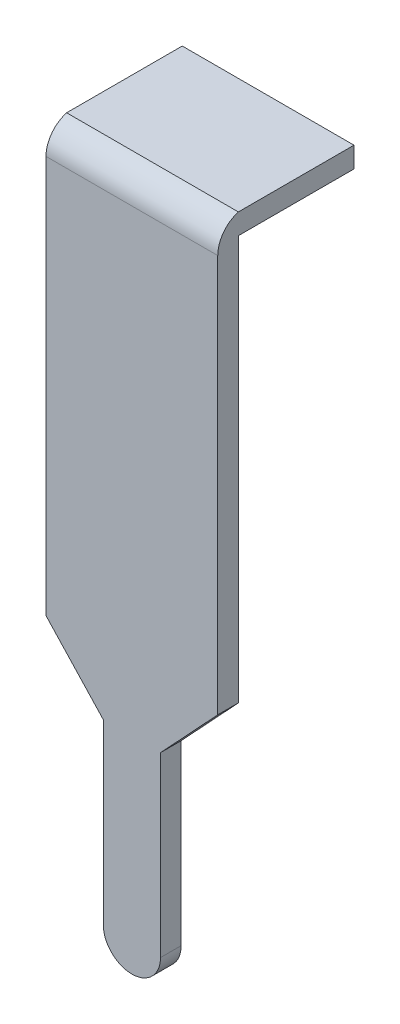
ISO-10303-21;
HEADER;
FILE_DESCRIPTION(('STEP AP214'),'2;1');
FILE_NAME('part.step','',(''),(''),'','','');
FILE_SCHEMA(('AUTOMOTIVE_DESIGN { 1 0 10303 214 1 1 1 1 }'));
ENDSEC;
DATA;
#1=APPLICATION_CONTEXT('core data for automotive mechanical design processes');
#2=APPLICATION_PROTOCOL_DEFINITION('international standard','automotive_design',2000,#1);
#3=PRODUCT_CONTEXT('',#1,'mechanical');
#4=PRODUCT('Part','Part','',(#3));
#5=PRODUCT_RELATED_PRODUCT_CATEGORY('part','',(#4));
#6=PRODUCT_DEFINITION_FORMATION('','',#4);
#7=PRODUCT_DEFINITION_CONTEXT('part definition',#1,'design');
#8=PRODUCT_DEFINITION('design','',#6,#7);
#9=PRODUCT_DEFINITION_SHAPE('','',#8);
#10=(LENGTH_UNIT() NAMED_UNIT(*) SI_UNIT(.MILLI.,.METRE.));
#11=(NAMED_UNIT(*) PLANE_ANGLE_UNIT() SI_UNIT($,.RADIAN.));
#12=(NAMED_UNIT(*) SI_UNIT($,.STERADIAN.) SOLID_ANGLE_UNIT());
#13=UNCERTAINTY_MEASURE_WITH_UNIT(LENGTH_MEASURE(1.E-05),#10,'distance_accuracy_value','');
#14=(GEOMETRIC_REPRESENTATION_CONTEXT(3) GLOBAL_UNCERTAINTY_ASSIGNED_CONTEXT((#13)) GLOBAL_UNIT_ASSIGNED_CONTEXT((#10,
#11,#12)) REPRESENTATION_CONTEXT('',''));
#15=CARTESIAN_POINT('',(0.,0.,0.));
#16=DIRECTION('',(0.,0.,1.));
#17=DIRECTION('',(1.,0.,0.));
#18=AXIS2_PLACEMENT_3D('',#15,#16,#17);
#19=CARTESIAN_POINT('',(1.5,8.12,6.18));
#20=DIRECTION('',(0.,0.,-1.));
#21=DIRECTION('',(0.,-1.,0.));
#22=AXIS2_PLACEMENT_3D('',#19,#20,#21);
#23=PLANE('',#22);
#24=DIRECTION('',(0.,-1.,0.));
#25=VECTOR('',#24,1.);
#26=CARTESIAN_POINT('',(-1.50000000001,8.12000000001,6.18000000001));
#27=LINE('',#26,#25);
#28=CARTESIAN_POINT('',(-1.5,8.12,6.18));
#29=VERTEX_POINT('',#28);
#30=CARTESIAN_POINT('',(-1.5,1.17236871025722,6.18));
#31=VERTEX_POINT('',#30);
#32=EDGE_CURVE('E148',#29,#31,#27,.T.);
#33=ORIENTED_EDGE('',*,*,#32,.T.);
#34=DIRECTION('',(-0.68199835994211,0.731353701731435,0.));
#35=VECTOR('',#34,1.);
#36=CARTESIAN_POINT('',(-1.50000000001,1.17236871019582,6.18000000001));
#37=LINE('',#36,#35);
#38=CARTESIAN_POINT('',(-0.500000000179763,0.1,6.18));
#39=VERTEX_POINT('',#38);
#40=EDGE_CURVE('E194',#39,#31,#37,.T.);
#41=ORIENTED_EDGE('',*,*,#40,.F.);
#42=DIRECTION('',(0.,1.,0.));
#43=VECTOR('',#42,1.);
#44=CARTESIAN_POINT('',(-0.500000000189763,0.10000000001,6.18000000001));
#45=LINE('',#44,#43);
#46=CARTESIAN_POINT('',(-0.500000000179763,-3.,6.18));
#47=VERTEX_POINT('',#46);
#48=EDGE_CURVE('E193',#47,#39,#45,.T.);
#49=ORIENTED_EDGE('',*,*,#48,.F.);
#50=CARTESIAN_POINT('',(-4.32867414187809E-11,-3.00000000001,6.18000000001));
#51=DIRECTION('',(0.,0.,-1.));
#52=DIRECTION('',(1.,0.,0.));
#53=AXIS2_PLACEMENT_3D('',#50,#51,#52);
#54=CIRCLE('',#53,0.5);
#55=CARTESIAN_POINT('',(0.50000000011319,-3.,6.18));
#56=VERTEX_POINT('',#55);
#57=EDGE_CURVE('E209',#56,#47,#54,.T.);
#58=ORIENTED_EDGE('',*,*,#57,.F.);
#59=DIRECTION('',(0.,-1.,0.));
#60=VECTOR('',#59,1.);
#61=CARTESIAN_POINT('',(0.50000000012319,-3.00000000001,6.18000000001));
#62=LINE('',#61,#60);
#63=CARTESIAN_POINT('',(0.50000000011319,0.1,6.18));
#64=VERTEX_POINT('',#63);
#65=EDGE_CURVE('E27',#64,#56,#62,.T.);
#66=ORIENTED_EDGE('',*,*,#65,.F.);
#67=DIRECTION('',(-0.681998359942109,-0.731353701731435,0.));
#68=VECTOR('',#67,1.);
#69=CARTESIAN_POINT('',(0.50000000012319,0.10000000001,6.18000000001));
#70=LINE('',#69,#68);
#71=CARTESIAN_POINT('',(1.5,1.17236871025721,6.18));
#72=VERTEX_POINT('',#71);
#73=EDGE_CURVE('E11',#72,#64,#70,.T.);
#74=ORIENTED_EDGE('',*,*,#73,.F.);
#75=DIRECTION('',(0.,-1.,0.));
#76=VECTOR('',#75,1.);
#77=CARTESIAN_POINT('',(1.50000000001,8.12000000001,6.18000000001));
#78=LINE('',#77,#76);
#79=CARTESIAN_POINT('',(1.5,8.12,6.18));
#80=VERTEX_POINT('',#79);
#81=EDGE_CURVE('E161',#80,#72,#78,.T.);
#82=ORIENTED_EDGE('',*,*,#81,.F.);
#83=DIRECTION('',(-1.,0.,0.));
#84=VECTOR('',#83,1.);
#85=CARTESIAN_POINT('',(1.50000000001,8.12000000001,6.18000000001));
#86=LINE('',#85,#84);
#87=EDGE_CURVE('E160',#80,#29,#86,.T.);
#88=ORIENTED_EDGE('',*,*,#87,.T.);
#89=EDGE_LOOP('',(#33,#41,#49,#58,#66,#74,#82,#88));
#90=FACE_BOUND('',#89,.T.);
#91=ADVANCED_FACE('F17',(#90),#23,.F.);
#92=CARTESIAN_POINT('',(0.50000000011319,0.1,-7.701));
#93=DIRECTION('',(-0.731353701731436,0.681998359942109,0.));
#94=DIRECTION('',(0.,0.,1.));
#95=AXIS2_PLACEMENT_3D('',#92,#93,#94);
#96=PLANE('',#95);
#97=DIRECTION('',(0.681998359942109,0.731353701731435,0.));
#98=VECTOR('',#97,1.);
#99=CARTESIAN_POINT('',(0.50000000012319,0.10000000001,5.82000000001));
#100=LINE('',#99,#98);
#101=CARTESIAN_POINT('',(0.50000000011319,0.1,5.82));
#102=VERTEX_POINT('',#101);
#103=CARTESIAN_POINT('',(1.5,1.17236871025721,5.82));
#104=VERTEX_POINT('',#103);
#105=EDGE_CURVE('E184',#102,#104,#100,.T.);
#106=ORIENTED_EDGE('',*,*,#105,.T.);
#107=DIRECTION('',(0.,0.,1.));
#108=VECTOR('',#107,1.);
#109=CARTESIAN_POINT('',(1.50000000001,1.17236871026721,-7.70100000001));
#110=LINE('',#109,#108);
#111=EDGE_CURVE('E114',#104,#72,#110,.T.);
#112=ORIENTED_EDGE('',*,*,#111,.T.);
#113=ORIENTED_EDGE('',*,*,#73,.T.);
#114=DIRECTION('',(0.,0.,1.));
#115=VECTOR('',#114,1.);
#116=CARTESIAN_POINT('',(0.50000000012319,0.10000000001,-7.70100000001));
#117=LINE('',#116,#115);
#118=EDGE_CURVE('E103',#102,#64,#117,.T.);
#119=ORIENTED_EDGE('',*,*,#118,.F.);
#120=EDGE_LOOP('',(#106,#112,#113,#119));
#121=FACE_BOUND('',#120,.T.);
#122=ADVANCED_FACE('F258',(#121),#96,.F.);
#123=CARTESIAN_POINT('',(0.50000000011319,-3.,-7.701));
#124=DIRECTION('',(-1.,0.,0.));
#125=DIRECTION('',(0.,0.,1.));
#126=AXIS2_PLACEMENT_3D('',#123,#124,#125);
#127=PLANE('',#126);
#128=DIRECTION('',(0.,1.,0.));
#129=VECTOR('',#128,1.);
#130=CARTESIAN_POINT('',(0.50000000012319,-3.00000000001,5.82000000001));
#131=LINE('',#130,#129);
#132=CARTESIAN_POINT('',(0.50000000011319,-3.,5.82));
#133=VERTEX_POINT('',#132);
#134=EDGE_CURVE('E187',#133,#102,#131,.T.);
#135=ORIENTED_EDGE('',*,*,#134,.T.);
#136=ORIENTED_EDGE('',*,*,#118,.T.);
#137=ORIENTED_EDGE('',*,*,#65,.T.);
#138=DIRECTION('',(0.,0.,1.));
#139=VECTOR('',#138,1.);
#140=CARTESIAN_POINT('',(0.50000000012319,-3.00000000001,-7.70100000001));
#141=LINE('',#140,#139);
#142=EDGE_CURVE('E218',#133,#56,#141,.T.);
#143=ORIENTED_EDGE('',*,*,#142,.F.);
#144=EDGE_LOOP('',(#135,#136,#137,#143));
#145=FACE_BOUND('',#144,.T.);
#146=ADVANCED_FACE('F296',(#145),#127,.F.);
#147=CARTESIAN_POINT('',(-3.3286741418781E-11,-3.,-7.701));
#148=DIRECTION('',(0.,0.,-1.));
#149=DIRECTION('',(1.,0.,0.));
#150=AXIS2_PLACEMENT_3D('',#147,#148,#149);
#151=CYLINDRICAL_SURFACE('',#150,0.5);
#152=CARTESIAN_POINT('',(-4.32867414187809E-11,-3.00000000001,5.82000000001));
#153=DIRECTION('',(0.,0.,1.));
#154=DIRECTION('',(1.,0.,0.));
#155=AXIS2_PLACEMENT_3D('',#152,#153,#154);
#156=CIRCLE('',#155,0.5);
#157=CARTESIAN_POINT('',(-0.500000000179763,-3.,5.82));
#158=VERTEX_POINT('',#157);
#159=EDGE_CURVE('E200',#158,#133,#156,.T.);
#160=ORIENTED_EDGE('',*,*,#159,.T.);
#161=ORIENTED_EDGE('',*,*,#142,.T.);
#162=ORIENTED_EDGE('',*,*,#57,.T.);
#163=DIRECTION('',(0.,0.,1.));
#164=VECTOR('',#163,1.);
#165=CARTESIAN_POINT('',(-0.500000000189763,-3.00000000001,-7.70100000001));
#166=LINE('',#165,#164);
#167=EDGE_CURVE('E189',#158,#47,#166,.T.);
#168=ORIENTED_EDGE('',*,*,#167,.F.);
#169=EDGE_LOOP('',(#160,#161,#162,#168));
#170=FACE_BOUND('',#169,.T.);
#171=ADVANCED_FACE('F294',(#170),#151,.T.);
#172=CARTESIAN_POINT('',(-0.500000000179763,0.1,-7.701));
#173=DIRECTION('',(1.,0.,0.));
#174=DIRECTION('',(0.,1.,0.));
#175=AXIS2_PLACEMENT_3D('',#172,#173,#174);
#176=PLANE('',#175);
#177=DIRECTION('',(0.,-1.,0.));
#178=VECTOR('',#177,1.);
#179=CARTESIAN_POINT('',(-0.500000000189763,0.10000000001,5.82000000001));
#180=LINE('',#179,#178);
#181=CARTESIAN_POINT('',(-0.500000000179763,0.1,5.82));
#182=VERTEX_POINT('',#181);
#183=EDGE_CURVE('E225',#182,#158,#180,.T.);
#184=ORIENTED_EDGE('',*,*,#183,.T.);
#185=ORIENTED_EDGE('',*,*,#167,.T.);
#186=ORIENTED_EDGE('',*,*,#48,.T.);
#187=DIRECTION('',(0.,0.,1.));
#188=VECTOR('',#187,1.);
#189=CARTESIAN_POINT('',(-0.500000000189763,0.10000000001,-7.70100000001));
#190=LINE('',#189,#188);
#191=EDGE_CURVE('E157',#182,#39,#190,.T.);
#192=ORIENTED_EDGE('',*,*,#191,.F.);
#193=EDGE_LOOP('',(#184,#185,#186,#192));
#194=FACE_BOUND('',#193,.T.);
#195=ADVANCED_FACE('F291',(#194),#176,.F.);
#196=CARTESIAN_POINT('',(-1.5,1.17236871018582,-7.701));
#197=DIRECTION('',(0.731353701731435,0.681998359942109,0.));
#198=DIRECTION('',(0.,0.,-1.));
#199=AXIS2_PLACEMENT_3D('',#196,#197,#198);
#200=PLANE('',#199);
#201=DIRECTION('',(0.68199835994211,-0.731353701731435,0.));
#202=VECTOR('',#201,1.);
#203=CARTESIAN_POINT('',(-1.50000000001,1.17236871019582,5.82000000001));
#204=LINE('',#203,#202);
#205=CARTESIAN_POINT('',(-1.5,1.17236871018582,5.82));
#206=VERTEX_POINT('',#205);
#207=EDGE_CURVE('E215',#206,#182,#204,.T.);
#208=ORIENTED_EDGE('',*,*,#207,.T.);
#209=ORIENTED_EDGE('',*,*,#191,.T.);
#210=ORIENTED_EDGE('',*,*,#40,.T.);
#211=DIRECTION('',(0.,0.,1.));
#212=VECTOR('',#211,1.);
#213=CARTESIAN_POINT('',(-1.50000000001,1.17236871019582,-7.70100000001));
#214=LINE('',#213,#212);
#215=EDGE_CURVE('E126',#206,#31,#214,.T.);
#216=ORIENTED_EDGE('',*,*,#215,.F.);
#217=EDGE_LOOP('',(#208,#209,#210,#216));
#218=FACE_BOUND('',#217,.T.);
#219=ADVANCED_FACE('F287',(#218),#200,.F.);
#220=CARTESIAN_POINT('',(-1.5,8.12,5.68));
#221=DIRECTION('',(1.,0.,0.));
#222=DIRECTION('',(0.,1.,0.));
#223=AXIS2_PLACEMENT_3D('',#220,#221,#222);
#224=PLANE('',#223);
#225=DIRECTION('',(0.,1.,0.));
#226=VECTOR('',#225,1.);
#227=CARTESIAN_POINT('',(-1.50000000001,-4.75056805533105,5.82000000001));
#228=LINE('',#227,#226);
#229=CARTESIAN_POINT('',(-1.5,8.24,5.82));
#230=VERTEX_POINT('',#229);
#231=EDGE_CURVE('E212',#206,#230,#228,.T.);
#232=ORIENTED_EDGE('',*,*,#231,.F.);
#233=ORIENTED_EDGE('',*,*,#215,.T.);
#234=ORIENTED_EDGE('',*,*,#32,.F.);
#235=CARTESIAN_POINT('',(-1.50000000001,8.12000000001,5.68000000001));
#236=DIRECTION('',(1.,0.,0.));
#237=DIRECTION('',(0.,0.,-1.));
#238=AXIS2_PLACEMENT_3D('',#235,#236,#237);
#239=CIRCLE('',#238,0.5);
#240=CARTESIAN_POINT('',(-1.5,8.6,5.82));
#241=VERTEX_POINT('',#240);
#242=EDGE_CURVE('E153',#241,#29,#239,.T.);
#243=ORIENTED_EDGE('',*,*,#242,.F.);
#244=DIRECTION('',(0.,0.,1.));
#245=VECTOR('',#244,1.);
#246=CARTESIAN_POINT('',(-1.50000000001,8.60000000001,5.82000000001));
#247=LINE('',#246,#245);
#248=CARTESIAN_POINT('',(-1.5,8.6,3.8));
#249=VERTEX_POINT('',#248);
#250=EDGE_CURVE('E195',#249,#241,#247,.T.);
#251=ORIENTED_EDGE('',*,*,#250,.F.);
#252=DIRECTION('',(0.,1.,0.));
#253=VECTOR('',#252,1.);
#254=CARTESIAN_POINT('',(-1.50000000001,8.60000000001,3.80000000001));
#255=LINE('',#254,#253);
#256=CARTESIAN_POINT('',(-1.5,8.24,3.8));
#257=VERTEX_POINT('',#256);
#258=EDGE_CURVE('E70',#257,#249,#255,.T.);
#259=ORIENTED_EDGE('',*,*,#258,.F.);
#260=DIRECTION('',(0.,0.,-1.));
#261=VECTOR('',#260,1.);
#262=CARTESIAN_POINT('',(-1.50000000001,8.24000000001,3.80000000001));
#263=LINE('',#262,#261);
#264=EDGE_CURVE('E179',#230,#257,#263,.T.);
#265=ORIENTED_EDGE('',*,*,#264,.F.);
#266=EDGE_LOOP('',(#232,#233,#234,#243,#251,#259,#265));
#267=FACE_BOUND('',#266,.T.);
#268=ADVANCED_FACE('F150',(#267),#224,.F.);
#269=CARTESIAN_POINT('',(1.5,8.12,5.68));
#270=DIRECTION('',(1.,0.,0.));
#271=DIRECTION('',(0.,1.,0.));
#272=AXIS2_PLACEMENT_3D('',#269,#270,#271);
#273=PLANE('',#272);
#274=ORIENTED_EDGE('',*,*,#111,.F.);
#275=DIRECTION('',(0.,1.,0.));
#276=VECTOR('',#275,1.);
#277=CARTESIAN_POINT('',(1.50000000001,-4.75056805533105,5.82000000001));
#278=LINE('',#277,#276);
#279=CARTESIAN_POINT('',(1.5,8.24,5.82));
#280=VERTEX_POINT('',#279);
#281=EDGE_CURVE('E188',#104,#280,#278,.T.);
#282=ORIENTED_EDGE('',*,*,#281,.T.);
#283=DIRECTION('',(0.,0.,-1.));
#284=VECTOR('',#283,1.);
#285=CARTESIAN_POINT('',(1.50000000001,8.24000000001,3.80000000001));
#286=LINE('',#285,#284);
#287=CARTESIAN_POINT('',(1.5,8.24,3.8));
#288=VERTEX_POINT('',#287);
#289=EDGE_CURVE('E182',#280,#288,#286,.T.);
#290=ORIENTED_EDGE('',*,*,#289,.T.);
#291=DIRECTION('',(0.,1.,0.));
#292=VECTOR('',#291,1.);
#293=CARTESIAN_POINT('',(1.50000000001,8.60000000001,3.80000000001));
#294=LINE('',#293,#292);
#295=CARTESIAN_POINT('',(1.5,8.6,3.8));
#296=VERTEX_POINT('',#295);
#297=EDGE_CURVE('E21',#288,#296,#294,.T.);
#298=ORIENTED_EDGE('',*,*,#297,.T.);
#299=DIRECTION('',(0.,0.,1.));
#300=VECTOR('',#299,1.);
#301=CARTESIAN_POINT('',(1.50000000001,8.60000000001,5.82000000001));
#302=LINE('',#301,#300);
#303=CARTESIAN_POINT('',(1.5,8.6,5.82));
#304=VERTEX_POINT('',#303);
#305=EDGE_CURVE('E83',#296,#304,#302,.T.);
#306=ORIENTED_EDGE('',*,*,#305,.T.);
#307=CARTESIAN_POINT('',(1.50000000001,8.12000000001,5.68000000001));
#308=DIRECTION('',(1.,0.,0.));
#309=DIRECTION('',(0.,0.,-1.));
#310=AXIS2_PLACEMENT_3D('',#307,#308,#309);
#311=CIRCLE('',#310,0.5);
#312=EDGE_CURVE('E165',#304,#80,#311,.T.);
#313=ORIENTED_EDGE('',*,*,#312,.T.);
#314=ORIENTED_EDGE('',*,*,#81,.T.);
#315=EDGE_LOOP('',(#274,#282,#290,#298,#306,#313,#314));
#316=FACE_BOUND('',#315,.T.);
#317=ADVANCED_FACE('F253',(#316),#273,.T.);
#318=CARTESIAN_POINT('',(1.5,-4.75056805532105,5.82));
#319=DIRECTION('',(0.,0.,1.));
#320=DIRECTION('',(1.,0.,0.));
#321=AXIS2_PLACEMENT_3D('',#318,#319,#320);
#322=PLANE('',#321);
#323=ORIENTED_EDGE('',*,*,#183,.F.);
#324=ORIENTED_EDGE('',*,*,#207,.F.);
#325=ORIENTED_EDGE('',*,*,#231,.T.);
#326=DIRECTION('',(-1.,0.,0.));
#327=VECTOR('',#326,1.);
#328=CARTESIAN_POINT('',(1.50000000001,8.24000000001,5.82000000001));
#329=LINE('',#328,#327);
#330=EDGE_CURVE('E221',#280,#230,#329,.T.);
#331=ORIENTED_EDGE('',*,*,#330,.F.);
#332=ORIENTED_EDGE('',*,*,#281,.F.);
#333=ORIENTED_EDGE('',*,*,#105,.F.);
#334=ORIENTED_EDGE('',*,*,#134,.F.);
#335=ORIENTED_EDGE('',*,*,#159,.F.);
#336=EDGE_LOOP('',(#323,#324,#325,#331,#332,#333,#334,#335));
#337=FACE_BOUND('',#336,.T.);
#338=ADVANCED_FACE('F19',(#337),#322,.F.);
#339=CARTESIAN_POINT('',(1.5,8.24,3.8));
#340=DIRECTION('',(0.,1.,0.));
#341=DIRECTION('',(1.,0.,0.));
#342=AXIS2_PLACEMENT_3D('',#339,#340,#341);
#343=PLANE('',#342);
#344=ORIENTED_EDGE('',*,*,#264,.T.);
#345=DIRECTION('',(-1.,0.,0.));
#346=VECTOR('',#345,1.);
#347=CARTESIAN_POINT('',(1.50000000001,8.24000000001,3.80000000001));
#348=LINE('',#347,#346);
#349=EDGE_CURVE('E183',#288,#257,#348,.T.);
#350=ORIENTED_EDGE('',*,*,#349,.F.);
#351=ORIENTED_EDGE('',*,*,#289,.F.);
#352=ORIENTED_EDGE('',*,*,#330,.T.);
#353=EDGE_LOOP('',(#344,#350,#351,#352));
#354=FACE_BOUND('',#353,.T.);
#355=ADVANCED_FACE('F305',(#354),#343,.F.);
#356=CARTESIAN_POINT('',(1.5,8.6,3.8));
#357=DIRECTION('',(0.,0.,1.));
#358=DIRECTION('',(1.,0.,0.));
#359=AXIS2_PLACEMENT_3D('',#356,#357,#358);
#360=PLANE('',#359);
#361=ORIENTED_EDGE('',*,*,#258,.T.);
#362=DIRECTION('',(-1.,0.,0.));
#363=VECTOR('',#362,1.);
#364=CARTESIAN_POINT('',(1.50000000001,8.60000000001,3.80000000001));
#365=LINE('',#364,#363);
#366=EDGE_CURVE('E204',#296,#249,#365,.T.);
#367=ORIENTED_EDGE('',*,*,#366,.F.);
#368=ORIENTED_EDGE('',*,*,#297,.F.);
#369=ORIENTED_EDGE('',*,*,#349,.T.);
#370=EDGE_LOOP('',(#361,#367,#368,#369));
#371=FACE_BOUND('',#370,.T.);
#372=ADVANCED_FACE('F309',(#371),#360,.F.);
#373=CARTESIAN_POINT('',(1.5,8.6,5.82));
#374=DIRECTION('',(0.,-1.,0.));
#375=DIRECTION('',(-1.,0.,0.));
#376=AXIS2_PLACEMENT_3D('',#373,#374,#375);
#377=PLANE('',#376);
#378=ORIENTED_EDGE('',*,*,#250,.T.);
#379=DIRECTION('',(-1.,0.,0.));
#380=VECTOR('',#379,1.);
#381=CARTESIAN_POINT('',(1.50000000001,8.60000000001,5.82000000001));
#382=LINE('',#381,#380);
#383=EDGE_CURVE('E169',#304,#241,#382,.T.);
#384=ORIENTED_EDGE('',*,*,#383,.F.);
#385=ORIENTED_EDGE('',*,*,#305,.F.);
#386=ORIENTED_EDGE('',*,*,#366,.T.);
#387=EDGE_LOOP('',(#378,#384,#385,#386));
#388=FACE_BOUND('',#387,.T.);
#389=ADVANCED_FACE('F307',(#388),#377,.F.);
#390=CARTESIAN_POINT('',(1.5,8.12,5.68));
#391=DIRECTION('',(1.,0.,0.));
#392=DIRECTION('',(0.,0.,1.));
#393=AXIS2_PLACEMENT_3D('',#390,#391,#392);
#394=CYLINDRICAL_SURFACE('',#393,0.5);
#395=ORIENTED_EDGE('',*,*,#242,.T.);
#396=ORIENTED_EDGE('',*,*,#87,.F.);
#397=ORIENTED_EDGE('',*,*,#312,.F.);
#398=ORIENTED_EDGE('',*,*,#383,.T.);
#399=EDGE_LOOP('',(#395,#396,#397,#398));
#400=FACE_BOUND('',#399,.T.);
#401=ADVANCED_FACE('F168',(#400),#394,.T.);
#402=CLOSED_SHELL('',(#91,#122,#146,#171,#195,#219,#268,#317,#338,#355,#372,#389,#401));
#403=MANIFOLD_SOLID_BREP('B1',#402);
#404=ADVANCED_BREP_SHAPE_REPRESENTATION('',(#18,#403),#14);
#405=SHAPE_DEFINITION_REPRESENTATION(#9,#404);
ENDSEC;
END-ISO-10303-21;
